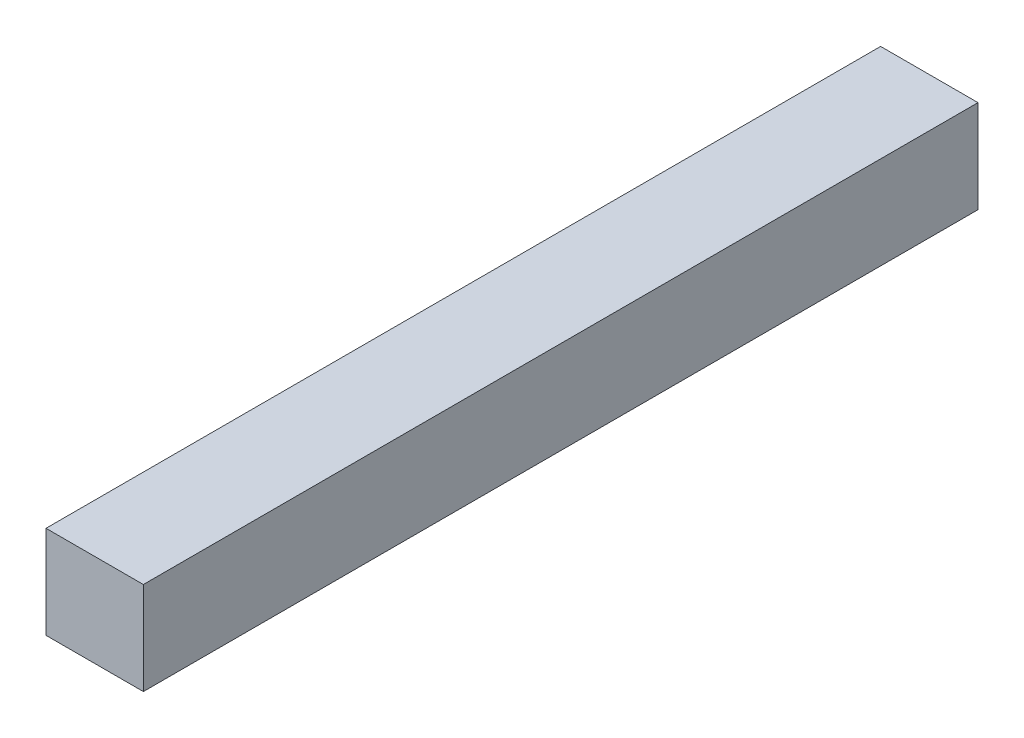
ISO-10303-21;
HEADER;
FILE_DESCRIPTION(('STEP AP214'),'2;1');
FILE_NAME('part.step','',(''),(''),'','','');
FILE_SCHEMA(('AUTOMOTIVE_DESIGN { 1 0 10303 214 1 1 1 1 }'));
ENDSEC;
DATA;
#1=APPLICATION_CONTEXT('core data for automotive mechanical design processes');
#2=APPLICATION_PROTOCOL_DEFINITION('international standard','automotive_design',2000,#1);
#3=PRODUCT_CONTEXT('',#1,'mechanical');
#4=PRODUCT('Part','Part','',(#3));
#5=PRODUCT_RELATED_PRODUCT_CATEGORY('part','',(#4));
#6=PRODUCT_DEFINITION_FORMATION('','',#4);
#7=PRODUCT_DEFINITION_CONTEXT('part definition',#1,'design');
#8=PRODUCT_DEFINITION('design','',#6,#7);
#9=PRODUCT_DEFINITION_SHAPE('','',#8);
#10=(LENGTH_UNIT() NAMED_UNIT(*) SI_UNIT(.MILLI.,.METRE.));
#11=(NAMED_UNIT(*) PLANE_ANGLE_UNIT() SI_UNIT($,.RADIAN.));
#12=(NAMED_UNIT(*) SI_UNIT($,.STERADIAN.) SOLID_ANGLE_UNIT());
#13=UNCERTAINTY_MEASURE_WITH_UNIT(LENGTH_MEASURE(1.E-05),#10,'distance_accuracy_value','');
#14=(GEOMETRIC_REPRESENTATION_CONTEXT(3) GLOBAL_UNCERTAINTY_ASSIGNED_CONTEXT((#13)) GLOBAL_UNIT_ASSIGNED_CONTEXT((#10,
#11,#12)) REPRESENTATION_CONTEXT('',''));
#15=CARTESIAN_POINT('',(0.,0.,0.));
#16=DIRECTION('',(0.,0.,1.));
#17=DIRECTION('',(1.,0.,0.));
#18=AXIS2_PLACEMENT_3D('',#15,#16,#17);
#19=CARTESIAN_POINT('',(-3.15,15.2,124.35));
#20=DIRECTION('',(0.,1.,0.));
#21=DIRECTION('',(0.,0.,1.));
#22=AXIS2_PLACEMENT_3D('',#19,#20,#21);
#23=PLANE('',#22);
#24=DIRECTION('',(1.,0.,0.));
#25=VECTOR('',#24,1.);
#26=CARTESIAN_POINT('',(-3.15,15.2,70.35));
#27=LINE('',#26,#25);
#28=CARTESIAN_POINT('',(-3.15,15.2,70.35));
#29=VERTEX_POINT('',#28);
#30=CARTESIAN_POINT('',(3.15,15.2,70.35));
#31=VERTEX_POINT('',#30);
#32=EDGE_CURVE('E91',#29,#31,#27,.T.);
#33=ORIENTED_EDGE('',*,*,#32,.F.);
#34=DIRECTION('',(0.,0.,-1.));
#35=VECTOR('',#34,1.);
#36=CARTESIAN_POINT('',(-3.15,15.2,124.35));
#37=LINE('',#36,#35);
#38=CARTESIAN_POINT('',(-3.15,15.2,124.35));
#39=VERTEX_POINT('',#38);
#40=EDGE_CURVE('E20',#39,#29,#37,.T.);
#41=ORIENTED_EDGE('',*,*,#40,.F.);
#42=DIRECTION('',(1.,0.,0.));
#43=VECTOR('',#42,1.);
#44=CARTESIAN_POINT('',(-3.15,15.2,124.35));
#45=LINE('',#44,#43);
#46=CARTESIAN_POINT('',(3.15,15.2,124.35));
#47=VERTEX_POINT('',#46);
#48=EDGE_CURVE('E71',#39,#47,#45,.T.);
#49=ORIENTED_EDGE('',*,*,#48,.T.);
#50=DIRECTION('',(0.,0.,-1.));
#51=VECTOR('',#50,1.);
#52=CARTESIAN_POINT('',(3.15,15.2,124.35));
#53=LINE('',#52,#51);
#54=EDGE_CURVE('E11',#47,#31,#53,.T.);
#55=ORIENTED_EDGE('',*,*,#54,.T.);
#56=EDGE_LOOP('',(#33,#41,#49,#55));
#57=FACE_BOUND('',#56,.T.);
#58=ADVANCED_FACE('F17',(#57),#23,.T.);
#59=CARTESIAN_POINT('',(3.15,15.2,124.35));
#60=DIRECTION('',(1.,0.,0.));
#61=DIRECTION('',(0.,1.,0.));
#62=AXIS2_PLACEMENT_3D('',#59,#60,#61);
#63=PLANE('',#62);
#64=DIRECTION('',(0.,-1.,0.));
#65=VECTOR('',#64,1.);
#66=CARTESIAN_POINT('',(3.15,15.2,70.35));
#67=LINE('',#66,#65);
#68=CARTESIAN_POINT('',(3.15,9.2,70.35));
#69=VERTEX_POINT('',#68);
#70=EDGE_CURVE('E65',#31,#69,#67,.T.);
#71=ORIENTED_EDGE('',*,*,#70,.F.);
#72=ORIENTED_EDGE('',*,*,#54,.F.);
#73=DIRECTION('',(0.,-1.,0.));
#74=VECTOR('',#73,1.);
#75=CARTESIAN_POINT('',(3.15,15.2,124.35));
#76=LINE('',#75,#74);
#77=CARTESIAN_POINT('',(3.15,9.2,124.35));
#78=VERTEX_POINT('',#77);
#79=EDGE_CURVE('E62',#47,#78,#76,.T.);
#80=ORIENTED_EDGE('',*,*,#79,.T.);
#81=DIRECTION('',(0.,0.,-1.));
#82=VECTOR('',#81,1.);
#83=CARTESIAN_POINT('',(3.15,9.2,124.35));
#84=LINE('',#83,#82);
#85=EDGE_CURVE('E27',#78,#69,#84,.T.);
#86=ORIENTED_EDGE('',*,*,#85,.T.);
#87=EDGE_LOOP('',(#71,#72,#80,#86));
#88=FACE_BOUND('',#87,.T.);
#89=ADVANCED_FACE('F61',(#88),#63,.T.);
#90=CARTESIAN_POINT('',(3.15,9.2,124.35));
#91=DIRECTION('',(0.,-1.,0.));
#92=DIRECTION('',(1.,0.,0.));
#93=AXIS2_PLACEMENT_3D('',#90,#91,#92);
#94=PLANE('',#93);
#95=DIRECTION('',(-1.,0.,0.));
#96=VECTOR('',#95,1.);
#97=CARTESIAN_POINT('',(3.15,9.2,70.35));
#98=LINE('',#97,#96);
#99=CARTESIAN_POINT('',(-3.15,9.2,70.35));
#100=VERTEX_POINT('',#99);
#101=EDGE_CURVE('E83',#69,#100,#98,.T.);
#102=ORIENTED_EDGE('',*,*,#101,.F.);
#103=ORIENTED_EDGE('',*,*,#85,.F.);
#104=DIRECTION('',(-1.,0.,0.));
#105=VECTOR('',#104,1.);
#106=CARTESIAN_POINT('',(3.15,9.2,124.35));
#107=LINE('',#106,#105);
#108=CARTESIAN_POINT('',(-3.15,9.2,124.35));
#109=VERTEX_POINT('',#108);
#110=EDGE_CURVE('E72',#78,#109,#107,.T.);
#111=ORIENTED_EDGE('',*,*,#110,.T.);
#112=DIRECTION('',(0.,0.,-1.));
#113=VECTOR('',#112,1.);
#114=CARTESIAN_POINT('',(-3.15,9.2,124.35));
#115=LINE('',#114,#113);
#116=EDGE_CURVE('E35',#109,#100,#115,.T.);
#117=ORIENTED_EDGE('',*,*,#116,.T.);
#118=EDGE_LOOP('',(#102,#103,#111,#117));
#119=FACE_BOUND('',#118,.T.);
#120=ADVANCED_FACE('F126',(#119),#94,.T.);
#121=CARTESIAN_POINT('',(-3.15,9.2,124.35));
#122=DIRECTION('',(-1.,0.,0.));
#123=DIRECTION('',(0.,-1.,0.));
#124=AXIS2_PLACEMENT_3D('',#121,#122,#123);
#125=PLANE('',#124);
#126=DIRECTION('',(0.,1.,0.));
#127=VECTOR('',#126,1.);
#128=CARTESIAN_POINT('',(-3.15,9.2,70.35));
#129=LINE('',#128,#127);
#130=EDGE_CURVE('E76',#100,#29,#129,.T.);
#131=ORIENTED_EDGE('',*,*,#130,.F.);
#132=ORIENTED_EDGE('',*,*,#116,.F.);
#133=DIRECTION('',(0.,1.,0.));
#134=VECTOR('',#133,1.);
#135=CARTESIAN_POINT('',(-3.15,9.2,124.35));
#136=LINE('',#135,#134);
#137=EDGE_CURVE('E88',#109,#39,#136,.T.);
#138=ORIENTED_EDGE('',*,*,#137,.T.);
#139=ORIENTED_EDGE('',*,*,#40,.T.);
#140=EDGE_LOOP('',(#131,#132,#138,#139));
#141=FACE_BOUND('',#140,.T.);
#142=ADVANCED_FACE('F131',(#141),#125,.T.);
#143=CARTESIAN_POINT('',(0.,0.,124.35));
#144=DIRECTION('',(0.,0.,-1.));
#145=DIRECTION('',(-1.,0.,0.));
#146=AXIS2_PLACEMENT_3D('',#143,#144,#145);
#147=PLANE('',#146);
#148=ORIENTED_EDGE('',*,*,#48,.F.);
#149=ORIENTED_EDGE('',*,*,#137,.F.);
#150=ORIENTED_EDGE('',*,*,#110,.F.);
#151=ORIENTED_EDGE('',*,*,#79,.F.);
#152=EDGE_LOOP('',(#148,#149,#150,#151));
#153=FACE_BOUND('',#152,.T.);
#154=ADVANCED_FACE('F69',(#153),#147,.F.);
#155=CARTESIAN_POINT('',(0.,0.,70.35));
#156=DIRECTION('',(0.,0.,-1.));
#157=DIRECTION('',(-1.,0.,0.));
#158=AXIS2_PLACEMENT_3D('',#155,#156,#157);
#159=PLANE('',#158);
#160=ORIENTED_EDGE('',*,*,#32,.T.);
#161=ORIENTED_EDGE('',*,*,#70,.T.);
#162=ORIENTED_EDGE('',*,*,#101,.T.);
#163=ORIENTED_EDGE('',*,*,#130,.T.);
#164=EDGE_LOOP('',(#160,#161,#162,#163));
#165=FACE_BOUND('',#164,.T.);
#166=ADVANCED_FACE('F115',(#165),#159,.T.);
#167=CLOSED_SHELL('',(#58,#89,#120,#142,#154,#166));
#168=MANIFOLD_SOLID_BREP('B1',#167);
#169=ADVANCED_BREP_SHAPE_REPRESENTATION('',(#18,#168),#14);
#170=SHAPE_DEFINITION_REPRESENTATION(#9,#169);
ENDSEC;
END-ISO-10303-21;
